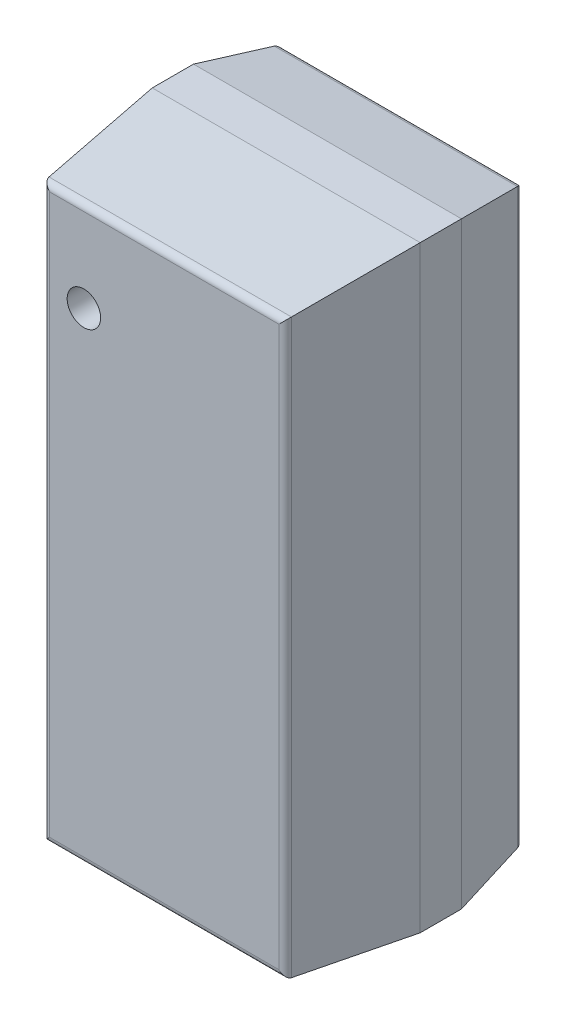
ISO-10303-21;
HEADER;
FILE_DESCRIPTION(('STEP AP214'),'2;1');
FILE_NAME('part.step','',(''),(''),'','','');
FILE_SCHEMA(('AUTOMOTIVE_DESIGN { 1 0 10303 214 1 1 1 1 }'));
ENDSEC;
DATA;
#1=APPLICATION_CONTEXT('core data for automotive mechanical design processes');
#2=APPLICATION_PROTOCOL_DEFINITION('international standard','automotive_design',2000,#1);
#3=PRODUCT_CONTEXT('',#1,'mechanical');
#4=PRODUCT('Part','Part','',(#3));
#5=PRODUCT_RELATED_PRODUCT_CATEGORY('part','',(#4));
#6=PRODUCT_DEFINITION_FORMATION('','',#4);
#7=PRODUCT_DEFINITION_CONTEXT('part definition',#1,'design');
#8=PRODUCT_DEFINITION('design','',#6,#7);
#9=PRODUCT_DEFINITION_SHAPE('','',#8);
#10=(LENGTH_UNIT() NAMED_UNIT(*) SI_UNIT(.MILLI.,.METRE.));
#11=(NAMED_UNIT(*) PLANE_ANGLE_UNIT() SI_UNIT($,.RADIAN.));
#12=(NAMED_UNIT(*) SI_UNIT($,.STERADIAN.) SOLID_ANGLE_UNIT());
#13=UNCERTAINTY_MEASURE_WITH_UNIT(LENGTH_MEASURE(1.E-05),#10,'distance_accuracy_value','');
#14=(GEOMETRIC_REPRESENTATION_CONTEXT(3) GLOBAL_UNCERTAINTY_ASSIGNED_CONTEXT((#13)) GLOBAL_UNIT_ASSIGNED_CONTEXT((#10,
#11,#12)) REPRESENTATION_CONTEXT('',''));
#15=CARTESIAN_POINT('',(0.,0.,0.));
#16=DIRECTION('',(0.,0.,1.));
#17=DIRECTION('',(1.,0.,0.));
#18=AXIS2_PLACEMENT_3D('',#15,#16,#17);
#19=CARTESIAN_POINT('',(-0.39,0.95,1.08));
#20=DIRECTION('',(0.,0.,1.));
#21=DIRECTION('',(1.,0.,0.));
#22=AXIS2_PLACEMENT_3D('',#19,#20,#21);
#23=PLANE('',#22);
#24=CARTESIAN_POINT('',(-0.39,0.95,1.08));
#25=DIRECTION('',(0.,0.,1.));
#26=DIRECTION('',(1.,0.,0.));
#27=AXIS2_PLACEMENT_3D('',#24,#25,#26);
#28=CIRCLE('',#27,0.08125);
#29=CARTESIAN_POINT('',(-0.30875,0.95,1.08));
#30=VERTEX_POINT('',#29);
#31=EDGE_CURVE('E19',#30,#30,#28,.T.);
#32=ORIENTED_EDGE('',*,*,#31,.T.);
#33=EDGE_LOOP('',(#32));
#34=FACE_BOUND('',#33,.T.);
#35=ADVANCED_FACE('F16',(#34),#23,.T.);
#36=CARTESIAN_POINT('',(-0.39,0.95,1.08));
#37=DIRECTION('',(0.,0.,1.));
#38=DIRECTION('',(1.,0.,0.));
#39=AXIS2_PLACEMENT_3D('',#36,#37,#38);
#40=CYLINDRICAL_SURFACE('',#39,0.08125);
#41=CARTESIAN_POINT('',(-0.39,0.95,1.2));
#42=DIRECTION('',(0.,0.,1.));
#43=DIRECTION('',(1.,0.,0.));
#44=AXIS2_PLACEMENT_3D('',#41,#42,#43);
#45=CIRCLE('',#44,0.08125);
#46=CARTESIAN_POINT('',(-0.30875,0.95,1.2));
#47=VERTEX_POINT('',#46);
#48=EDGE_CURVE('E99',#47,#47,#45,.F.);
#49=ORIENTED_EDGE('',*,*,#48,.F.);
#50=EDGE_LOOP('',(#49));
#51=FACE_BOUND('',#50,.T.);
#52=ORIENTED_EDGE('',*,*,#31,.F.);
#53=EDGE_LOOP('',(#52));
#54=FACE_BOUND('',#53,.T.);
#55=ADVANCED_FACE('F495',(#51,#54),#40,.F.);
#56=CARTESIAN_POINT('',(-0.65,-1.45,1.2));
#57=DIRECTION('',(0.,0.,1.));
#58=DIRECTION('',(1.,0.,0.));
#59=AXIS2_PLACEMENT_3D('',#56,#57,#58);
#60=PLANE('',#59);
#61=ORIENTED_EDGE('',*,*,#48,.T.);
#62=EDGE_LOOP('',(#61));
#63=FACE_BOUND('',#62,.T.);
#64=DIRECTION('',(0.,1.,0.));
#65=VECTOR('',#64,1.);
#66=CARTESIAN_POINT('',(0.555874850105,-1.385,1.2));
#67=LINE('',#66,#65);
#68=CARTESIAN_POINT('',(0.555874850105,1.355874850105,1.2));
#69=VERTEX_POINT('',#68);
#70=CARTESIAN_POINT('',(0.555874850105,-1.355874850105,1.2));
#71=VERTEX_POINT('',#70);
#72=EDGE_CURVE('E106',#69,#71,#67,.F.);
#73=ORIENTED_EDGE('',*,*,#72,.F.);
#74=DIRECTION('',(1.,0.,0.));
#75=VECTOR('',#74,1.);
#76=CARTESIAN_POINT('',(-0.65,1.355874850105,1.2));
#77=LINE('',#76,#75);
#78=CARTESIAN_POINT('',(-0.555874850105,1.355874850105,1.2));
#79=VERTEX_POINT('',#78);
#80=EDGE_CURVE('E95',#69,#79,#77,.F.);
#81=ORIENTED_EDGE('',*,*,#80,.T.);
#82=DIRECTION('',(0.,1.,0.));
#83=VECTOR('',#82,1.);
#84=CARTESIAN_POINT('',(-0.555874850105,-1.385,1.2));
#85=LINE('',#84,#83);
#86=CARTESIAN_POINT('',(-0.555874850105,-1.355874850105,1.2));
#87=VERTEX_POINT('',#86);
#88=EDGE_CURVE('E91',#87,#79,#85,.T.);
#89=ORIENTED_EDGE('',*,*,#88,.F.);
#90=DIRECTION('',(1.,0.,0.));
#91=VECTOR('',#90,1.);
#92=CARTESIAN_POINT('',(-0.585,-1.355874850105,1.2));
#93=LINE('',#92,#91);
#94=EDGE_CURVE('E80',#71,#87,#93,.F.);
#95=ORIENTED_EDGE('',*,*,#94,.F.);
#96=EDGE_LOOP('',(#73,#81,#89,#95));
#97=FACE_BOUND('',#96,.T.);
#98=ADVANCED_FACE('F94',(#63,#97),#60,.T.);
#99=CARTESIAN_POINT('',(-0.555874850105,-1.385,1.1675));
#100=DIRECTION('',(0.,1.,0.));
#101=DIRECTION('',(0.,0.,1.));
#102=AXIS2_PLACEMENT_3D('',#99,#100,#101);
#103=CYLINDRICAL_SURFACE('',#102,0.0325);
#104=CARTESIAN_POINT('',(-0.555874850105,1.355874850105,1.1675));
#105=DIRECTION('',(0.707106781186547,0.707106781186547,0.));
#106=DIRECTION('',(0.707106781186547,-0.707106781186547,0.));
#107=AXIS2_PLACEMENT_3D('',#104,#105,#106);
#108=ELLIPSE('',#107,0.0459619407771256,0.0325);
#109=CARTESIAN_POINT('',(-0.58818049059019,1.38818049059019,1.17104902702887));
#110=VERTEX_POINT('',#109);
#111=EDGE_CURVE('E128',#110,#79,#108,.T.);
#112=ORIENTED_EDGE('',*,*,#111,.F.);
#113=DIRECTION('',(0.,1.,0.));
#114=VECTOR('',#113,1.);
#115=CARTESIAN_POINT('',(-0.588180490590326,-1.45,1.17104902702904));
#116=LINE('',#115,#114);
#117=CARTESIAN_POINT('',(-0.58818049059019,-1.38818049059019,1.17104902702887));
#118=VERTEX_POINT('',#117);
#119=EDGE_CURVE('E103',#110,#118,#116,.F.);
#120=ORIENTED_EDGE('',*,*,#119,.T.);
#121=CARTESIAN_POINT('',(-0.555874850105,-1.355874850105,1.1675));
#122=DIRECTION('',(0.707106781186547,-0.707106781186547,0.));
#123=DIRECTION('',(0.707106781186547,0.707106781186547,0.));
#124=AXIS2_PLACEMENT_3D('',#121,#122,#123);
#125=ELLIPSE('',#124,0.0459619407771256,0.0325);
#126=EDGE_CURVE('E85',#87,#118,#125,.T.);
#127=ORIENTED_EDGE('',*,*,#126,.F.);
#128=ORIENTED_EDGE('',*,*,#88,.T.);
#129=EDGE_LOOP('',(#112,#120,#127,#128));
#130=FACE_BOUND('',#129,.T.);
#131=ADVANCED_FACE('F102',(#130),#103,.T.);
#132=CARTESIAN_POINT('',(-0.585,-1.355874850105,1.1675));
#133=DIRECTION('',(1.,0.,0.));
#134=DIRECTION('',(0.,0.,-1.));
#135=AXIS2_PLACEMENT_3D('',#132,#133,#134);
#136=CYLINDRICAL_SURFACE('',#135,0.0325);
#137=ORIENTED_EDGE('',*,*,#94,.T.);
#138=ORIENTED_EDGE('',*,*,#126,.T.);
#139=DIRECTION('',(1.,0.,0.));
#140=VECTOR('',#139,1.);
#141=CARTESIAN_POINT('',(-0.65,-1.38818049059033,1.17104902702904));
#142=LINE('',#141,#140);
#143=CARTESIAN_POINT('',(0.58818049059019,-1.38818049059019,1.17104902702887));
#144=VERTEX_POINT('',#143);
#145=EDGE_CURVE('E140',#118,#144,#142,.T.);
#146=ORIENTED_EDGE('',*,*,#145,.T.);
#147=CARTESIAN_POINT('',(0.555874850105,-1.355874850105,1.1675));
#148=DIRECTION('',(0.707106781186547,0.707106781186547,0.));
#149=DIRECTION('',(-0.707106781186547,0.707106781186547,0.));
#150=AXIS2_PLACEMENT_3D('',#147,#148,#149);
#151=ELLIPSE('',#150,0.0459619407771256,0.0325);
#152=EDGE_CURVE('E87',#71,#144,#151,.T.);
#153=ORIENTED_EDGE('',*,*,#152,.F.);
#154=EDGE_LOOP('',(#137,#138,#146,#153));
#155=FACE_BOUND('',#154,.T.);
#156=ADVANCED_FACE('F82',(#155),#136,.T.);
#157=CARTESIAN_POINT('',(0.555874850105,-1.385,1.1675));
#158=DIRECTION('',(0.,1.,0.));
#159=DIRECTION('',(0.,0.,1.));
#160=AXIS2_PLACEMENT_3D('',#157,#158,#159);
#161=CYLINDRICAL_SURFACE('',#160,0.0325);
#162=CARTESIAN_POINT('',(0.555874850105,1.355874850105,1.1675));
#163=DIRECTION('',(0.707106781186547,-0.707106781186547,0.));
#164=DIRECTION('',(0.707106781186547,0.707106781186547,0.));
#165=AXIS2_PLACEMENT_3D('',#162,#163,#164);
#166=ELLIPSE('',#165,0.0459619407771256,0.0325);
#167=CARTESIAN_POINT('',(0.58818049059019,1.38818049059019,1.17104902702887));
#168=VERTEX_POINT('',#167);
#169=EDGE_CURVE('E129',#69,#168,#166,.F.);
#170=ORIENTED_EDGE('',*,*,#169,.F.);
#171=ORIENTED_EDGE('',*,*,#72,.T.);
#172=ORIENTED_EDGE('',*,*,#152,.T.);
#173=DIRECTION('',(0.,1.,0.));
#174=VECTOR('',#173,1.);
#175=CARTESIAN_POINT('',(0.588180490590326,-1.45,1.17104902702904));
#176=LINE('',#175,#174);
#177=EDGE_CURVE('E138',#168,#144,#176,.F.);
#178=ORIENTED_EDGE('',*,*,#177,.F.);
#179=EDGE_LOOP('',(#170,#171,#172,#178));
#180=FACE_BOUND('',#179,.T.);
#181=ADVANCED_FACE('F462',(#180),#161,.T.);
#182=CARTESIAN_POINT('',(-0.585,1.355874850105,1.1675));
#183=DIRECTION('',(1.,0.,0.));
#184=DIRECTION('',(0.,0.,-1.));
#185=AXIS2_PLACEMENT_3D('',#182,#183,#184);
#186=CYLINDRICAL_SURFACE('',#185,0.0325);
#187=DIRECTION('',(1.,0.,0.));
#188=VECTOR('',#187,1.);
#189=CARTESIAN_POINT('',(-0.65,1.38818049059033,1.17104902702904));
#190=LINE('',#189,#188);
#191=EDGE_CURVE('E148',#110,#168,#190,.T.);
#192=ORIENTED_EDGE('',*,*,#191,.F.);
#193=ORIENTED_EDGE('',*,*,#111,.T.);
#194=ORIENTED_EDGE('',*,*,#80,.F.);
#195=ORIENTED_EDGE('',*,*,#169,.T.);
#196=EDGE_LOOP('',(#192,#193,#194,#195));
#197=FACE_BOUND('',#196,.T.);
#198=ADVANCED_FACE('F452',(#197),#186,.T.);
#199=CARTESIAN_POINT('',(-0.6175,-1.45,0.904163054471));
#200=DIRECTION('',(0.994019707232458,0.,-0.10920083165205));
#201=DIRECTION('',(-0.10920083165205,0.,-0.994019707232458));
#202=AXIS2_PLACEMENT_3D('',#199,#200,#201);
#203=PLANE('',#202);
#204=DIRECTION('',(0.108555497353366,-0.108555497352994,0.988145438682387));
#205=VECTOR('',#204,1.);
#206=CARTESIAN_POINT('',(-0.65,1.45000000000011,0.608326108942012));
#207=LINE('',#206,#205);
#208=CARTESIAN_POINT('',(-0.65,1.45000000000003,0.608326108942003));
#209=VERTEX_POINT('',#208);
#210=EDGE_CURVE('E154',#209,#110,#207,.T.);
#211=ORIENTED_EDGE('',*,*,#210,.F.);
#212=DIRECTION('',(0.,1.,0.));
#213=VECTOR('',#212,1.);
#214=CARTESIAN_POINT('',(-0.65,-1.45,0.608326108942));
#215=LINE('',#214,#213);
#216=CARTESIAN_POINT('',(-0.65,-1.45000000000003,0.608326108942003));
#217=VERTEX_POINT('',#216);
#218=EDGE_CURVE('E182',#209,#217,#215,.F.);
#219=ORIENTED_EDGE('',*,*,#218,.T.);
#220=DIRECTION('',(0.108555497353366,0.108555497352994,0.988145438682387));
#221=VECTOR('',#220,1.);
#222=CARTESIAN_POINT('',(-0.65,-1.45000000000011,0.608326108942012));
#223=LINE('',#222,#221);
#224=EDGE_CURVE('E141',#217,#118,#223,.T.);
#225=ORIENTED_EDGE('',*,*,#224,.T.);
#226=ORIENTED_EDGE('',*,*,#119,.F.);
#227=EDGE_LOOP('',(#211,#219,#225,#226));
#228=FACE_BOUND('',#227,.T.);
#229=ADVANCED_FACE('F443',(#228),#203,.F.);
#230=CARTESIAN_POINT('',(-0.65,-1.4175,0.904163054471));
#231=DIRECTION('',(0.,0.994019707232458,-0.10920083165205));
#232=DIRECTION('',(0.,0.10920083165205,0.994019707232458));
#233=AXIS2_PLACEMENT_3D('',#230,#231,#232);
#234=PLANE('',#233);
#235=DIRECTION('',(1.,0.,0.));
#236=VECTOR('',#235,1.);
#237=CARTESIAN_POINT('',(-0.65,-1.45,0.608326108942));
#238=LINE('',#237,#236);
#239=CARTESIAN_POINT('',(0.650000000000028,-1.45,0.608326108942003));
#240=VERTEX_POINT('',#239);
#241=EDGE_CURVE('E169',#217,#240,#238,.T.);
#242=ORIENTED_EDGE('',*,*,#241,.T.);
#243=DIRECTION('',(0.108555497352994,-0.108555497353366,-0.988145438682387));
#244=VECTOR('',#243,1.);
#245=CARTESIAN_POINT('',(0.588180490590326,-1.38818049059,1.17104902702904));
#246=LINE('',#245,#244);
#247=EDGE_CURVE('E143',#144,#240,#246,.T.);
#248=ORIENTED_EDGE('',*,*,#247,.F.);
#249=ORIENTED_EDGE('',*,*,#145,.F.);
#250=ORIENTED_EDGE('',*,*,#224,.F.);
#251=EDGE_LOOP('',(#242,#248,#249,#250));
#252=FACE_BOUND('',#251,.T.);
#253=ADVANCED_FACE('F434',(#252),#234,.F.);
#254=CARTESIAN_POINT('',(0.6175,-1.45,0.904163054471));
#255=DIRECTION('',(0.994019707232458,0.,0.10920083165205));
#256=DIRECTION('',(0.10920083165205,0.,-0.994019707232458));
#257=AXIS2_PLACEMENT_3D('',#254,#255,#256);
#258=PLANE('',#257);
#259=DIRECTION('',(0.108555497353366,0.108555497352994,-0.988145438682387));
#260=VECTOR('',#259,1.);
#261=CARTESIAN_POINT('',(0.588180490590001,1.38818049059033,1.17104902702904));
#262=LINE('',#261,#260);
#263=CARTESIAN_POINT('',(0.65,1.45000000000003,0.608326108942003));
#264=VERTEX_POINT('',#263);
#265=EDGE_CURVE('E149',#168,#264,#262,.T.);
#266=ORIENTED_EDGE('',*,*,#265,.F.);
#267=ORIENTED_EDGE('',*,*,#177,.T.);
#268=ORIENTED_EDGE('',*,*,#247,.T.);
#269=DIRECTION('',(0.,1.,0.));
#270=VECTOR('',#269,1.);
#271=CARTESIAN_POINT('',(0.65,-1.45,0.608326108942));
#272=LINE('',#271,#270);
#273=EDGE_CURVE('E179',#264,#240,#272,.F.);
#274=ORIENTED_EDGE('',*,*,#273,.F.);
#275=EDGE_LOOP('',(#266,#267,#268,#274));
#276=FACE_BOUND('',#275,.T.);
#277=ADVANCED_FACE('F425',(#276),#258,.T.);
#278=CARTESIAN_POINT('',(-0.65,1.4175,0.904163054471));
#279=DIRECTION('',(0.,0.994019707232458,0.10920083165205));
#280=DIRECTION('',(0.,-0.10920083165205,0.994019707232458));
#281=AXIS2_PLACEMENT_3D('',#278,#279,#280);
#282=PLANE('',#281);
#283=DIRECTION('',(1.,0.,0.));
#284=VECTOR('',#283,1.);
#285=CARTESIAN_POINT('',(-0.65,1.45,0.608326108942));
#286=LINE('',#285,#284);
#287=EDGE_CURVE('E201',#209,#264,#286,.T.);
#288=ORIENTED_EDGE('',*,*,#287,.F.);
#289=ORIENTED_EDGE('',*,*,#210,.T.);
#290=ORIENTED_EDGE('',*,*,#191,.T.);
#291=ORIENTED_EDGE('',*,*,#265,.T.);
#292=EDGE_LOOP('',(#288,#289,#290,#291));
#293=FACE_BOUND('',#292,.T.);
#294=ADVANCED_FACE('F416',(#293),#282,.T.);
#295=CARTESIAN_POINT('',(-0.65,-1.45,0.05));
#296=DIRECTION('',(1.,0.,0.));
#297=DIRECTION('',(0.,0.,-1.));
#298=AXIS2_PLACEMENT_3D('',#295,#296,#297);
#299=PLANE('',#298);
#300=DIRECTION('',(0.,0.,1.));
#301=VECTOR('',#300,1.);
#302=CARTESIAN_POINT('',(-0.65,1.45,0.05));
#303=LINE('',#302,#301);
#304=CARTESIAN_POINT('',(-0.649999999999994,1.44999999999998,0.408326108942003));
#305=VERTEX_POINT('',#304);
#306=EDGE_CURVE('E205',#305,#209,#303,.T.);
#307=ORIENTED_EDGE('',*,*,#306,.F.);
#308=DIRECTION('',(0.,1.,0.));
#309=VECTOR('',#308,1.);
#310=CARTESIAN_POINT('',(-0.649999999999976,-1.45,0.408326108942004));
#311=LINE('',#310,#309);
#312=CARTESIAN_POINT('',(-0.649999999999994,-1.44999999999999,0.408326108942003));
#313=VERTEX_POINT('',#312);
#314=EDGE_CURVE('E204',#313,#305,#311,.T.);
#315=ORIENTED_EDGE('',*,*,#314,.F.);
#316=DIRECTION('',(0.,0.,1.));
#317=VECTOR('',#316,1.);
#318=CARTESIAN_POINT('',(-0.65,-1.45,0.05));
#319=LINE('',#318,#317);
#320=EDGE_CURVE('E172',#313,#217,#319,.T.);
#321=ORIENTED_EDGE('',*,*,#320,.T.);
#322=ORIENTED_EDGE('',*,*,#218,.F.);
#323=EDGE_LOOP('',(#307,#315,#321,#322));
#324=FACE_BOUND('',#323,.T.);
#325=ADVANCED_FACE('F406',(#324),#299,.F.);
#326=CARTESIAN_POINT('',(-0.65,-1.45,0.05));
#327=DIRECTION('',(0.,1.,0.));
#328=DIRECTION('',(0.,0.,1.));
#329=AXIS2_PLACEMENT_3D('',#326,#327,#328);
#330=PLANE('',#329);
#331=ORIENTED_EDGE('',*,*,#320,.F.);
#332=DIRECTION('',(1.,0.,0.));
#333=VECTOR('',#332,1.);
#334=CARTESIAN_POINT('',(-0.65,-1.44999999999998,0.408326108942004));
#335=LINE('',#334,#333);
#336=CARTESIAN_POINT('',(0.649999999999988,-1.44999999999999,0.408326108942004));
#337=VERTEX_POINT('',#336);
#338=EDGE_CURVE('E234',#337,#313,#335,.F.);
#339=ORIENTED_EDGE('',*,*,#338,.F.);
#340=DIRECTION('',(0.,0.,-1.));
#341=VECTOR('',#340,1.);
#342=CARTESIAN_POINT('',(0.65,-1.45,0.05));
#343=LINE('',#342,#341);
#344=EDGE_CURVE('E171',#240,#337,#343,.T.);
#345=ORIENTED_EDGE('',*,*,#344,.F.);
#346=ORIENTED_EDGE('',*,*,#241,.F.);
#347=EDGE_LOOP('',(#331,#339,#345,#346));
#348=FACE_BOUND('',#347,.T.);
#349=ADVANCED_FACE('F397',(#348),#330,.F.);
#350=CARTESIAN_POINT('',(0.65,-1.45,0.05));
#351=DIRECTION('',(1.,0.,0.));
#352=DIRECTION('',(0.,0.,-1.));
#353=AXIS2_PLACEMENT_3D('',#350,#351,#352);
#354=PLANE('',#353);
#355=DIRECTION('',(0.,0.,1.));
#356=VECTOR('',#355,1.);
#357=CARTESIAN_POINT('',(0.65,1.45,0.05));
#358=LINE('',#357,#356);
#359=CARTESIAN_POINT('',(0.649999999999994,1.44999999999999,0.408326108942004));
#360=VERTEX_POINT('',#359);
#361=EDGE_CURVE('E209',#264,#360,#358,.F.);
#362=ORIENTED_EDGE('',*,*,#361,.F.);
#363=ORIENTED_EDGE('',*,*,#273,.T.);
#364=ORIENTED_EDGE('',*,*,#344,.T.);
#365=DIRECTION('',(0.,1.,0.));
#366=VECTOR('',#365,1.);
#367=CARTESIAN_POINT('',(0.649999999999976,-1.45,0.408326108942004));
#368=LINE('',#367,#366);
#369=EDGE_CURVE('E227',#337,#360,#368,.T.);
#370=ORIENTED_EDGE('',*,*,#369,.T.);
#371=EDGE_LOOP('',(#362,#363,#364,#370));
#372=FACE_BOUND('',#371,.T.);
#373=ADVANCED_FACE('F388',(#372),#354,.T.);
#374=CARTESIAN_POINT('',(-0.65,1.45,0.05));
#375=DIRECTION('',(0.,1.,0.));
#376=DIRECTION('',(0.,0.,1.));
#377=AXIS2_PLACEMENT_3D('',#374,#375,#376);
#378=PLANE('',#377);
#379=ORIENTED_EDGE('',*,*,#306,.T.);
#380=ORIENTED_EDGE('',*,*,#287,.T.);
#381=ORIENTED_EDGE('',*,*,#361,.T.);
#382=DIRECTION('',(1.,0.,0.));
#383=VECTOR('',#382,1.);
#384=CARTESIAN_POINT('',(-0.65,1.44999999999998,0.408326108942004));
#385=LINE('',#384,#383);
#386=EDGE_CURVE('E253',#360,#305,#385,.F.);
#387=ORIENTED_EDGE('',*,*,#386,.T.);
#388=EDGE_LOOP('',(#379,#380,#381,#387));
#389=FACE_BOUND('',#388,.T.);
#390=ADVANCED_FACE('F379',(#389),#378,.T.);
#391=CARTESIAN_POINT('',(-0.6175,-1.45,0.229163054471));
#392=DIRECTION('',(-0.983942419384467,0.,-0.178486176876085));
#393=DIRECTION('',(-0.178486176876085,0.,0.983942419384467));
#394=AXIS2_PLACEMENT_3D('',#391,#392,#393);
#395=PLANE('',#394);
#396=DIRECTION('',(0.175709306017604,-0.175709306016703,-0.968634337383277));
#397=VECTOR('',#396,1.);
#398=CARTESIAN_POINT('',(-0.65,1.44999999999998,0.408326108942004));
#399=LINE('',#398,#397);
#400=CARTESIAN_POINT('',(-0.589843208205997,1.38984320820614,0.0766991992515212));
#401=VERTEX_POINT('',#400);
#402=EDGE_CURVE('E255',#305,#401,#399,.T.);
#403=ORIENTED_EDGE('',*,*,#402,.T.);
#404=DIRECTION('',(0.,1.,0.));
#405=VECTOR('',#404,1.);
#406=CARTESIAN_POINT('',(-0.589843208205996,-1.385,0.0766991992515308));
#407=LINE('',#406,#405);
#408=CARTESIAN_POINT('',(-0.589843208205997,-1.38984320820614,0.0766991992515212));
#409=VERTEX_POINT('',#408);
#410=EDGE_CURVE('E127',#409,#401,#407,.T.);
#411=ORIENTED_EDGE('',*,*,#410,.F.);
#412=DIRECTION('',(0.175709306017604,0.175709306016703,-0.968634337383277));
#413=VECTOR('',#412,1.);
#414=CARTESIAN_POINT('',(-0.65,-1.44999999999998,0.408326108942004));
#415=LINE('',#414,#413);
#416=EDGE_CURVE('E236',#313,#409,#415,.T.);
#417=ORIENTED_EDGE('',*,*,#416,.F.);
#418=ORIENTED_EDGE('',*,*,#314,.T.);
#419=EDGE_LOOP('',(#403,#411,#417,#418));
#420=FACE_BOUND('',#419,.T.);
#421=ADVANCED_FACE('F300',(#420),#395,.T.);
#422=CARTESIAN_POINT('',(-0.65,-1.4175,0.229163054471));
#423=DIRECTION('',(0.,-0.983942419384467,-0.178486176876085));
#424=DIRECTION('',(0.,0.178486176876085,-0.983942419384467));
#425=AXIS2_PLACEMENT_3D('',#422,#423,#424);
#426=PLANE('',#425);
#427=ORIENTED_EDGE('',*,*,#338,.T.);
#428=ORIENTED_EDGE('',*,*,#416,.T.);
#429=DIRECTION('',(1.,0.,0.));
#430=VECTOR('',#429,1.);
#431=CARTESIAN_POINT('',(-0.585,-1.389843208206,0.0766991992515308));
#432=LINE('',#431,#430);
#433=CARTESIAN_POINT('',(0.589843208206143,-1.389843208206,0.0766991992515212));
#434=VERTEX_POINT('',#433);
#435=EDGE_CURVE('E126',#434,#409,#432,.F.);
#436=ORIENTED_EDGE('',*,*,#435,.F.);
#437=DIRECTION('',(0.175709306016703,-0.175709306017604,0.968634337383277));
#438=VECTOR('',#437,1.);
#439=CARTESIAN_POINT('',(0.589843208206284,-1.389843208206,0.0766991992514784));
#440=LINE('',#439,#438);
#441=EDGE_CURVE('E230',#434,#337,#440,.T.);
#442=ORIENTED_EDGE('',*,*,#441,.T.);
#443=EDGE_LOOP('',(#427,#428,#436,#442));
#444=FACE_BOUND('',#443,.T.);
#445=ADVANCED_FACE('F274',(#444),#426,.T.);
#446=CARTESIAN_POINT('',(0.6175,-1.45,0.229163054471));
#447=DIRECTION('',(-0.983942419384467,0.,0.178486176876085));
#448=DIRECTION('',(0.178486176876085,0.,0.983942419384467));
#449=AXIS2_PLACEMENT_3D('',#446,#447,#448);
#450=PLANE('',#449);
#451=DIRECTION('',(0.175709306017604,0.175709306016703,0.968634337383277));
#452=VECTOR('',#451,1.);
#453=CARTESIAN_POINT('',(0.589843208206001,1.38984320820628,0.0766991992514784));
#454=LINE('',#453,#452);
#455=CARTESIAN_POINT('',(0.589843208205998,1.38984320820614,0.0766991992515212));
#456=VERTEX_POINT('',#455);
#457=EDGE_CURVE('E229',#456,#360,#454,.T.);
#458=ORIENTED_EDGE('',*,*,#457,.T.);
#459=ORIENTED_EDGE('',*,*,#369,.F.);
#460=ORIENTED_EDGE('',*,*,#441,.F.);
#461=DIRECTION('',(0.,1.,0.));
#462=VECTOR('',#461,1.);
#463=CARTESIAN_POINT('',(0.589843208205996,-1.385,0.0766991992515308));
#464=LINE('',#463,#462);
#465=EDGE_CURVE('E123',#456,#434,#464,.F.);
#466=ORIENTED_EDGE('',*,*,#465,.F.);
#467=EDGE_LOOP('',(#458,#459,#460,#466));
#468=FACE_BOUND('',#467,.T.);
#469=ADVANCED_FACE('F279',(#468),#450,.F.);
#470=CARTESIAN_POINT('',(-0.65,1.4175,0.229163054471));
#471=DIRECTION('',(0.,-0.983942419384467,0.178486176876085));
#472=DIRECTION('',(0.,-0.178486176876085,-0.983942419384467));
#473=AXIS2_PLACEMENT_3D('',#470,#471,#472);
#474=PLANE('',#473);
#475=ORIENTED_EDGE('',*,*,#386,.F.);
#476=ORIENTED_EDGE('',*,*,#457,.F.);
#477=DIRECTION('',(1.,0.,0.));
#478=VECTOR('',#477,1.);
#479=CARTESIAN_POINT('',(-0.585,1.389843208206,0.0766991992515308));
#480=LINE('',#479,#478);
#481=EDGE_CURVE('E117',#401,#456,#480,.T.);
#482=ORIENTED_EDGE('',*,*,#481,.F.);
#483=ORIENTED_EDGE('',*,*,#402,.F.);
#484=EDGE_LOOP('',(#475,#476,#482,#483));
#485=FACE_BOUND('',#484,.T.);
#486=ADVANCED_FACE('F302',(#485),#474,.F.);
#487=CARTESIAN_POINT('',(-0.557865079576,-1.385,0.0825));
#488=DIRECTION('',(0.,1.,0.));
#489=DIRECTION('',(0.,0.,1.));
#490=AXIS2_PLACEMENT_3D('',#487,#488,#489);
#491=CYLINDRICAL_SURFACE('',#490,0.0325);
#492=DIRECTION('',(0.,1.,0.));
#493=VECTOR('',#492,1.);
#494=CARTESIAN_POINT('',(-0.557865079576,-1.45,0.05));
#495=LINE('',#494,#493);
#496=CARTESIAN_POINT('',(-0.557865079576,1.357865079576,0.05));
#497=VERTEX_POINT('',#496);
#498=CARTESIAN_POINT('',(-0.557865079576,-1.357865079576,0.05));
#499=VERTEX_POINT('',#498);
#500=EDGE_CURVE('E116',#497,#499,#495,.F.);
#501=ORIENTED_EDGE('',*,*,#500,.T.);
#502=CARTESIAN_POINT('',(-0.557865079576,-1.357865079576,0.0825));
#503=DIRECTION('',(0.707106781186547,-0.707106781186547,0.));
#504=DIRECTION('',(0.707106781186547,0.707106781186547,0.));
#505=AXIS2_PLACEMENT_3D('',#502,#503,#504);
#506=ELLIPSE('',#505,0.0459619407771256,0.0325);
#507=EDGE_CURVE('E124',#409,#499,#506,.T.);
#508=ORIENTED_EDGE('',*,*,#507,.F.);
#509=ORIENTED_EDGE('',*,*,#410,.T.);
#510=CARTESIAN_POINT('',(-0.557865079576,1.357865079576,0.0825));
#511=DIRECTION('',(0.707106781186547,0.707106781186547,0.));
#512=DIRECTION('',(0.707106781186547,-0.707106781186547,0.));
#513=AXIS2_PLACEMENT_3D('',#510,#511,#512);
#514=ELLIPSE('',#513,0.0459619407771256,0.0325);
#515=EDGE_CURVE('E118',#497,#401,#514,.T.);
#516=ORIENTED_EDGE('',*,*,#515,.F.);
#517=EDGE_LOOP('',(#501,#508,#509,#516));
#518=FACE_BOUND('',#517,.T.);
#519=ADVANCED_FACE('F296',(#518),#491,.T.);
#520=CARTESIAN_POINT('',(-0.585,-1.357865079576,0.0825));
#521=DIRECTION('',(1.,0.,0.));
#522=DIRECTION('',(0.,0.,-1.));
#523=AXIS2_PLACEMENT_3D('',#520,#521,#522);
#524=CYLINDRICAL_SURFACE('',#523,0.0325);
#525=CARTESIAN_POINT('',(0.557865079576,-1.357865079576,0.0825));
#526=DIRECTION('',(0.707106781186547,0.707106781186547,0.));
#527=DIRECTION('',(-0.707106781186547,0.707106781186547,0.));
#528=AXIS2_PLACEMENT_3D('',#525,#526,#527);
#529=ELLIPSE('',#528,0.0459619407771256,0.0325);
#530=CARTESIAN_POINT('',(0.557865079576,-1.357865079576,0.05));
#531=VERTEX_POINT('',#530);
#532=EDGE_CURVE('E121',#434,#531,#529,.T.);
#533=ORIENTED_EDGE('',*,*,#532,.F.);
#534=ORIENTED_EDGE('',*,*,#435,.T.);
#535=ORIENTED_EDGE('',*,*,#507,.T.);
#536=DIRECTION('',(1.,0.,0.));
#537=VECTOR('',#536,1.);
#538=CARTESIAN_POINT('',(-0.65,-1.357865079576,0.05));
#539=LINE('',#538,#537);
#540=EDGE_CURVE('E288',#499,#531,#539,.T.);
#541=ORIENTED_EDGE('',*,*,#540,.T.);
#542=EDGE_LOOP('',(#533,#534,#535,#541));
#543=FACE_BOUND('',#542,.T.);
#544=ADVANCED_FACE('F309',(#543),#524,.T.);
#545=CARTESIAN_POINT('',(0.557865079576,-1.385,0.0825));
#546=DIRECTION('',(0.,1.,0.));
#547=DIRECTION('',(0.,0.,1.));
#548=AXIS2_PLACEMENT_3D('',#545,#546,#547);
#549=CYLINDRICAL_SURFACE('',#548,0.0325);
#550=ORIENTED_EDGE('',*,*,#465,.T.);
#551=ORIENTED_EDGE('',*,*,#532,.T.);
#552=DIRECTION('',(0.,1.,0.));
#553=VECTOR('',#552,1.);
#554=CARTESIAN_POINT('',(0.557865079576,-1.45,0.05));
#555=LINE('',#554,#553);
#556=CARTESIAN_POINT('',(0.557865079576,1.357865079576,0.05));
#557=VERTEX_POINT('',#556);
#558=EDGE_CURVE('E25',#531,#557,#555,.T.);
#559=ORIENTED_EDGE('',*,*,#558,.T.);
#560=CARTESIAN_POINT('',(0.557865079576,1.357865079576,0.0825));
#561=DIRECTION('',(0.707106781186547,-0.707106781186547,0.));
#562=DIRECTION('',(0.707106781186547,0.707106781186547,0.));
#563=AXIS2_PLACEMENT_3D('',#560,#561,#562);
#564=ELLIPSE('',#563,0.0459619407771256,0.0325);
#565=EDGE_CURVE('E33',#456,#557,#564,.F.);
#566=ORIENTED_EDGE('',*,*,#565,.F.);
#567=EDGE_LOOP('',(#550,#551,#559,#566));
#568=FACE_BOUND('',#567,.T.);
#569=ADVANCED_FACE('F281',(#568),#549,.T.);
#570=CARTESIAN_POINT('',(-0.585,1.357865079576,0.0825));
#571=DIRECTION('',(1.,0.,0.));
#572=DIRECTION('',(0.,0.,-1.));
#573=AXIS2_PLACEMENT_3D('',#570,#571,#572);
#574=CYLINDRICAL_SURFACE('',#573,0.0325);
#575=ORIENTED_EDGE('',*,*,#565,.T.);
#576=DIRECTION('',(1.,0.,0.));
#577=VECTOR('',#576,1.);
#578=CARTESIAN_POINT('',(-0.65,1.357865079576,0.05));
#579=LINE('',#578,#577);
#580=EDGE_CURVE('E11',#557,#497,#579,.F.);
#581=ORIENTED_EDGE('',*,*,#580,.T.);
#582=ORIENTED_EDGE('',*,*,#515,.T.);
#583=ORIENTED_EDGE('',*,*,#481,.T.);
#584=EDGE_LOOP('',(#575,#581,#582,#583));
#585=FACE_BOUND('',#584,.T.);
#586=ADVANCED_FACE('F297',(#585),#574,.T.);
#587=CARTESIAN_POINT('',(-0.65,-1.45,0.05));
#588=DIRECTION('',(0.,0.,1.));
#589=DIRECTION('',(1.,0.,0.));
#590=AXIS2_PLACEMENT_3D('',#587,#588,#589);
#591=PLANE('',#590);
#592=ORIENTED_EDGE('',*,*,#558,.F.);
#593=ORIENTED_EDGE('',*,*,#540,.F.);
#594=ORIENTED_EDGE('',*,*,#500,.F.);
#595=ORIENTED_EDGE('',*,*,#580,.F.);
#596=EDGE_LOOP('',(#592,#593,#594,#595));
#597=FACE_BOUND('',#596,.T.);
#598=ADVANCED_FACE('F307',(#597),#591,.F.);
#599=CLOSED_SHELL('',(#35,#55,#98,#131,#156,#181,#198,#229,#253,#277,#294,#325,#349,#373,#390,
#421,#445,#469,#486,#519,#544,#569,#586,#598));
#600=MANIFOLD_SOLID_BREP('B1',#599);
#601=ADVANCED_BREP_SHAPE_REPRESENTATION('',(#18,#600),#14);
#602=SHAPE_DEFINITION_REPRESENTATION(#9,#601);
ENDSEC;
END-ISO-10303-21;
